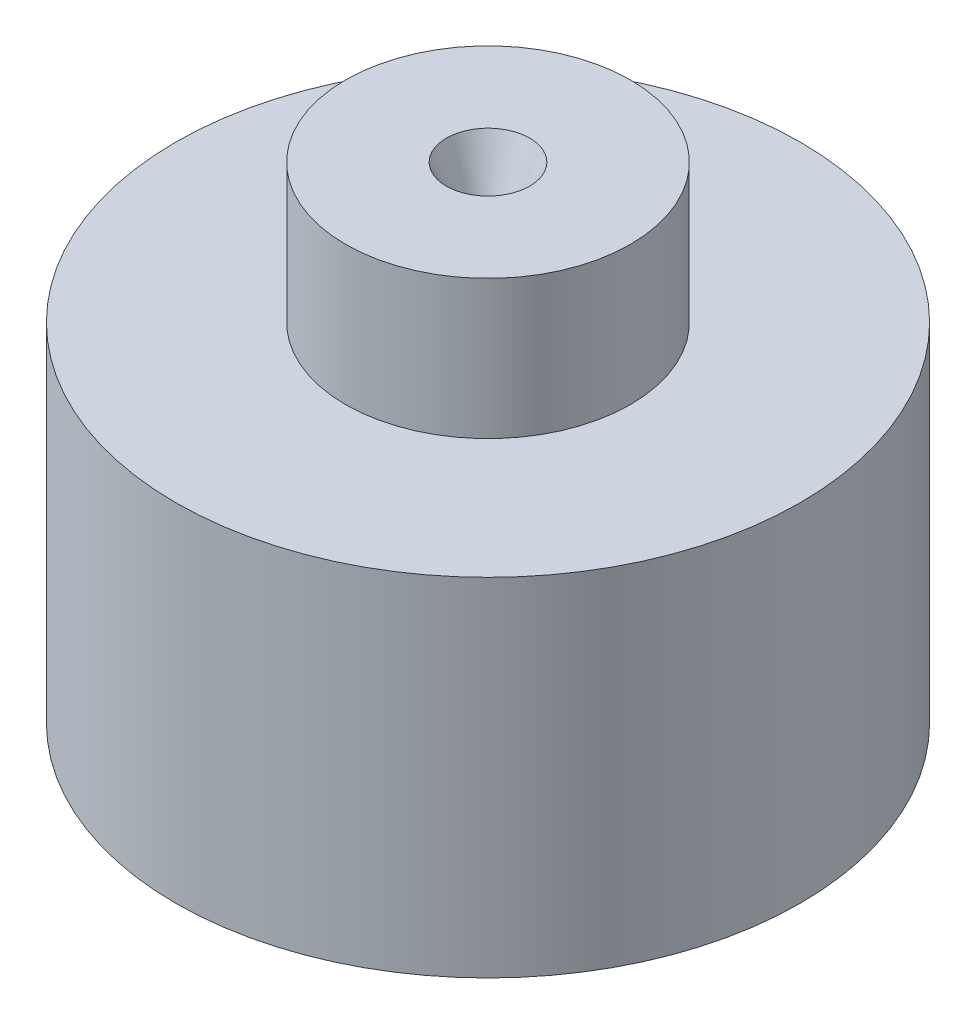
ISO-10303-21;
HEADER;
FILE_DESCRIPTION(('STEP AP214'),'2;1');
FILE_NAME('part.step','',(''),(''),'','','');
FILE_SCHEMA(('AUTOMOTIVE_DESIGN { 1 0 10303 214 1 1 1 1 }'));
ENDSEC;
DATA;
#1=APPLICATION_CONTEXT('core data for automotive mechanical design processes');
#2=APPLICATION_PROTOCOL_DEFINITION('international standard','automotive_design',2000,#1);
#3=PRODUCT_CONTEXT('',#1,'mechanical');
#4=PRODUCT('Part','Part','',(#3));
#5=PRODUCT_RELATED_PRODUCT_CATEGORY('part','',(#4));
#6=PRODUCT_DEFINITION_FORMATION('','',#4);
#7=PRODUCT_DEFINITION_CONTEXT('part definition',#1,'design');
#8=PRODUCT_DEFINITION('design','',#6,#7);
#9=PRODUCT_DEFINITION_SHAPE('','',#8);
#10=(LENGTH_UNIT() NAMED_UNIT(*) SI_UNIT(.MILLI.,.METRE.));
#11=(NAMED_UNIT(*) PLANE_ANGLE_UNIT() SI_UNIT($,.RADIAN.));
#12=(NAMED_UNIT(*) SI_UNIT($,.STERADIAN.) SOLID_ANGLE_UNIT());
#13=UNCERTAINTY_MEASURE_WITH_UNIT(LENGTH_MEASURE(1.E-05),#10,'distance_accuracy_value','');
#14=(GEOMETRIC_REPRESENTATION_CONTEXT(3) GLOBAL_UNCERTAINTY_ASSIGNED_CONTEXT((#13)) GLOBAL_UNIT_ASSIGNED_CONTEXT((#10,
#11,#12)) REPRESENTATION_CONTEXT('',''));
#15=CARTESIAN_POINT('',(0.,0.,0.));
#16=DIRECTION('',(0.,0.,1.));
#17=DIRECTION('',(1.,0.,0.));
#18=AXIS2_PLACEMENT_3D('',#15,#16,#17);
#19=CARTESIAN_POINT('',(0.,50.,0.));
#20=DIRECTION('',(0.,-1.,0.));
#21=DIRECTION('',(0.,0.,-1.));
#22=AXIS2_PLACEMENT_3D('',#19,#20,#21);
#23=CYLINDRICAL_SURFACE('',#22,45.);
#24=CARTESIAN_POINT('',(0.,50.,0.));
#25=DIRECTION('',(0.,1.,0.));
#26=DIRECTION('',(0.,0.,1.));
#27=AXIS2_PLACEMENT_3D('',#24,#25,#26);
#28=CIRCLE('',#27,45.);
#29=CARTESIAN_POINT('',(0.,50.,45.));
#30=VERTEX_POINT('',#29);
#31=EDGE_CURVE('E54',#30,#30,#28,.T.);
#32=ORIENTED_EDGE('',*,*,#31,.F.);
#33=EDGE_LOOP('',(#32));
#34=FACE_BOUND('',#33,.T.);
#35=CARTESIAN_POINT('',(0.,0.,0.));
#36=DIRECTION('',(0.,1.,0.));
#37=DIRECTION('',(0.,0.,1.));
#38=AXIS2_PLACEMENT_3D('',#35,#36,#37);
#39=CIRCLE('',#38,45.);
#40=CARTESIAN_POINT('',(0.,0.,45.));
#41=VERTEX_POINT('',#40);
#42=EDGE_CURVE('E60',#41,#41,#39,.T.);
#43=ORIENTED_EDGE('',*,*,#42,.T.);
#44=EDGE_LOOP('',(#43));
#45=FACE_BOUND('',#44,.T.);
#46=ADVANCED_FACE('F47',(#34,#45),#23,.T.);
#47=CARTESIAN_POINT('',(0.,50.,0.));
#48=DIRECTION('',(0.,1.,0.));
#49=DIRECTION('',(0.,0.,1.));
#50=AXIS2_PLACEMENT_3D('',#47,#48,#49);
#51=PLANE('',#50);
#52=CARTESIAN_POINT('',(0.,50.,0.));
#53=DIRECTION('',(0.,1.,0.));
#54=DIRECTION('',(0.,0.,1.));
#55=AXIS2_PLACEMENT_3D('',#52,#53,#54);
#56=CIRCLE('',#55,20.5229399547566);
#57=CARTESIAN_POINT('',(0.,50.,20.5229399547565));
#58=VERTEX_POINT('',#57);
#59=EDGE_CURVE('E10',#58,#58,#56,.T.);
#60=ORIENTED_EDGE('',*,*,#59,.F.);
#61=EDGE_LOOP('',(#60));
#62=FACE_BOUND('',#61,.T.);
#63=ORIENTED_EDGE('',*,*,#31,.T.);
#64=EDGE_LOOP('',(#63));
#65=FACE_BOUND('',#64,.T.);
#66=ADVANCED_FACE('F119',(#62,#65),#51,.T.);
#67=CARTESIAN_POINT('',(0.,0.,0.));
#68=DIRECTION('',(0.,1.,0.));
#69=DIRECTION('',(0.,0.,1.));
#70=AXIS2_PLACEMENT_3D('',#67,#68,#69);
#71=PLANE('',#70);
#72=CARTESIAN_POINT('',(0.,0.,0.));
#73=DIRECTION('',(0.,1.,0.));
#74=DIRECTION('',(0.,0.,1.));
#75=AXIS2_PLACEMENT_3D('',#72,#73,#74);
#76=CIRCLE('',#75,40.);
#77=CARTESIAN_POINT('',(0.,0.,40.));
#78=VERTEX_POINT('',#77);
#79=EDGE_CURVE('E67',#78,#78,#76,.T.);
#80=ORIENTED_EDGE('',*,*,#79,.T.);
#81=EDGE_LOOP('',(#80));
#82=FACE_BOUND('',#81,.T.);
#83=ORIENTED_EDGE('',*,*,#42,.F.);
#84=EDGE_LOOP('',(#83));
#85=FACE_BOUND('',#84,.T.);
#86=ADVANCED_FACE('F123',(#82,#85),#71,.F.);
#87=CARTESIAN_POINT('',(0.,50.,0.));
#88=DIRECTION('',(0.,1.,0.));
#89=DIRECTION('',(0.,0.,1.));
#90=AXIS2_PLACEMENT_3D('',#87,#88,#89);
#91=CYLINDRICAL_SURFACE('',#90,40.);
#92=ORIENTED_EDGE('',*,*,#79,.F.);
#93=EDGE_LOOP('',(#92));
#94=FACE_BOUND('',#93,.T.);
#95=CARTESIAN_POINT('',(0.,9.99999999999988,0.));
#96=DIRECTION('',(0.,1.,0.));
#97=DIRECTION('',(0.,0.,1.));
#98=AXIS2_PLACEMENT_3D('',#95,#96,#97);
#99=CIRCLE('',#98,40.);
#100=CARTESIAN_POINT('',(0.,9.99999999999989,40.));
#101=VERTEX_POINT('',#100);
#102=EDGE_CURVE('E72',#101,#101,#99,.T.);
#103=ORIENTED_EDGE('',*,*,#102,.T.);
#104=EDGE_LOOP('',(#103));
#105=FACE_BOUND('',#104,.T.);
#106=ADVANCED_FACE('F130',(#94,#105),#91,.F.);
#107=CARTESIAN_POINT('',(0.,9.99999999999989,40.));
#108=DIRECTION('',(0.,1.,0.));
#109=DIRECTION('',(0.,0.,1.));
#110=AXIS2_PLACEMENT_3D('',#107,#108,#109);
#111=PLANE('',#110);
#112=ORIENTED_EDGE('',*,*,#102,.F.);
#113=EDGE_LOOP('',(#112));
#114=FACE_BOUND('',#113,.T.);
#115=CARTESIAN_POINT('',(0.,9.99999999999988,0.));
#116=DIRECTION('',(0.,1.,0.));
#117=DIRECTION('',(0.,0.,1.));
#118=AXIS2_PLACEMENT_3D('',#115,#116,#117);
#119=CIRCLE('',#118,37.);
#120=CARTESIAN_POINT('',(0.,9.9999999999999,37.));
#121=VERTEX_POINT('',#120);
#122=EDGE_CURVE('E76',#121,#121,#119,.T.);
#123=ORIENTED_EDGE('',*,*,#122,.T.);
#124=EDGE_LOOP('',(#123));
#125=FACE_BOUND('',#124,.T.);
#126=ADVANCED_FACE('F134',(#114,#125),#111,.F.);
#127=CARTESIAN_POINT('',(0.,41.,0.));
#128=DIRECTION('',(0.,-1.,0.));
#129=DIRECTION('',(0.,0.,-1.));
#130=AXIS2_PLACEMENT_3D('',#127,#128,#129);
#131=CONICAL_SURFACE('',#130,6.00000000000001,0.785398163397446);
#132=ORIENTED_EDGE('',*,*,#122,.F.);
#133=EDGE_LOOP('',(#132));
#134=FACE_BOUND('',#133,.T.);
#135=CARTESIAN_POINT('',(0.,41.,0.));
#136=DIRECTION('',(0.,1.,0.));
#137=DIRECTION('',(0.,0.,1.));
#138=AXIS2_PLACEMENT_3D('',#135,#136,#137);
#139=CIRCLE('',#138,6.00000000000001);
#140=CARTESIAN_POINT('',(0.,41.,6.));
#141=VERTEX_POINT('',#140);
#142=EDGE_CURVE('E80',#141,#141,#139,.T.);
#143=ORIENTED_EDGE('',*,*,#142,.T.);
#144=EDGE_LOOP('',(#143));
#145=FACE_BOUND('',#144,.T.);
#146=ADVANCED_FACE('F140',(#134,#145),#131,.F.);
#147=CARTESIAN_POINT('',(0.,50.,0.));
#148=DIRECTION('',(0.,1.,0.));
#149=DIRECTION('',(0.,0.,1.));
#150=AXIS2_PLACEMENT_3D('',#147,#148,#149);
#151=CYLINDRICAL_SURFACE('',#150,6.00000000000001);
#152=ORIENTED_EDGE('',*,*,#142,.F.);
#153=EDGE_LOOP('',(#152));
#154=FACE_BOUND('',#153,.T.);
#155=CARTESIAN_POINT('',(0.,50.,0.));
#156=DIRECTION('',(0.,1.,0.));
#157=DIRECTION('',(0.,0.,1.));
#158=AXIS2_PLACEMENT_3D('',#155,#156,#157);
#159=CIRCLE('',#158,6.00000000000001);
#160=CARTESIAN_POINT('',(0.,50.,6.));
#161=VERTEX_POINT('',#160);
#162=EDGE_CURVE('E100',#161,#161,#159,.T.);
#163=ORIENTED_EDGE('',*,*,#162,.T.);
#164=EDGE_LOOP('',(#163));
#165=FACE_BOUND('',#164,.T.);
#166=ADVANCED_FACE('F106',(#154,#165),#151,.F.);
#167=CARTESIAN_POINT('',(0.,70.,0.));
#168=DIRECTION('',(0.,1.,0.));
#169=DIRECTION('',(0.,0.,1.));
#170=AXIS2_PLACEMENT_3D('',#167,#168,#169);
#171=CYLINDRICAL_SURFACE('',#170,20.5229399547566);
#172=ORIENTED_EDGE('',*,*,#59,.T.);
#173=EDGE_LOOP('',(#172));
#174=FACE_BOUND('',#173,.T.);
#175=CARTESIAN_POINT('',(0.,70.,0.));
#176=DIRECTION('',(0.,1.,0.));
#177=DIRECTION('',(0.,0.,1.));
#178=AXIS2_PLACEMENT_3D('',#175,#176,#177);
#179=CIRCLE('',#178,20.5229399547565);
#180=CARTESIAN_POINT('',(0.,70.,20.5229399547565));
#181=VERTEX_POINT('',#180);
#182=EDGE_CURVE('E84',#181,#181,#179,.T.);
#183=ORIENTED_EDGE('',*,*,#182,.F.);
#184=EDGE_LOOP('',(#183));
#185=FACE_BOUND('',#184,.T.);
#186=ADVANCED_FACE('F147',(#174,#185),#171,.T.);
#187=CARTESIAN_POINT('',(0.,70.,20.5229399547565));
#188=DIRECTION('',(0.,1.,0.));
#189=DIRECTION('',(0.,0.,1.));
#190=AXIS2_PLACEMENT_3D('',#187,#188,#189);
#191=PLANE('',#190);
#192=ORIENTED_EDGE('',*,*,#182,.T.);
#193=EDGE_LOOP('',(#192));
#194=FACE_BOUND('',#193,.T.);
#195=CARTESIAN_POINT('',(0.,70.,0.));
#196=DIRECTION('',(0.,1.,0.));
#197=DIRECTION('',(0.,0.,1.));
#198=AXIS2_PLACEMENT_3D('',#195,#196,#197);
#199=CIRCLE('',#198,6.);
#200=CARTESIAN_POINT('',(0.,70.,6.));
#201=VERTEX_POINT('',#200);
#202=EDGE_CURVE('E88',#201,#201,#199,.T.);
#203=ORIENTED_EDGE('',*,*,#202,.F.);
#204=EDGE_LOOP('',(#203));
#205=FACE_BOUND('',#204,.T.);
#206=ADVANCED_FACE('F151',(#194,#205),#191,.T.);
#207=CARTESIAN_POINT('',(0.,61.,0.));
#208=DIRECTION('',(0.,1.,0.));
#209=DIRECTION('',(0.,0.,1.));
#210=AXIS2_PLACEMENT_3D('',#207,#208,#209);
#211=CONICAL_SURFACE('',#210,2.24986987724109,0.394803438950979);
#212=ORIENTED_EDGE('',*,*,#202,.T.);
#213=EDGE_LOOP('',(#212));
#214=FACE_BOUND('',#213,.T.);
#215=CARTESIAN_POINT('',(0.,61.,0.));
#216=DIRECTION('',(0.,1.,0.));
#217=DIRECTION('',(0.,0.,1.));
#218=AXIS2_PLACEMENT_3D('',#215,#216,#217);
#219=CIRCLE('',#218,2.24986987724109);
#220=CARTESIAN_POINT('',(0.,61.,2.24986987724108));
#221=VERTEX_POINT('',#220);
#222=EDGE_CURVE('E92',#221,#221,#219,.T.);
#223=ORIENTED_EDGE('',*,*,#222,.F.);
#224=EDGE_LOOP('',(#223));
#225=FACE_BOUND('',#224,.T.);
#226=ADVANCED_FACE('F115',(#214,#225),#211,.F.);
#227=CARTESIAN_POINT('',(0.,70.,0.));
#228=DIRECTION('',(0.,1.,0.));
#229=DIRECTION('',(0.,0.,1.));
#230=AXIS2_PLACEMENT_3D('',#227,#228,#229);
#231=CYLINDRICAL_SURFACE('',#230,2.24986987724109);
#232=ORIENTED_EDGE('',*,*,#222,.T.);
#233=EDGE_LOOP('',(#232));
#234=FACE_BOUND('',#233,.T.);
#235=CARTESIAN_POINT('',(0.,59.,0.));
#236=DIRECTION('',(0.,1.,0.));
#237=DIRECTION('',(0.,0.,1.));
#238=AXIS2_PLACEMENT_3D('',#235,#236,#237);
#239=CIRCLE('',#238,2.24986987724109);
#240=CARTESIAN_POINT('',(0.,59.,2.24986987724108));
#241=VERTEX_POINT('',#240);
#242=EDGE_CURVE('E96',#241,#241,#239,.T.);
#243=ORIENTED_EDGE('',*,*,#242,.F.);
#244=EDGE_LOOP('',(#243));
#245=FACE_BOUND('',#244,.T.);
#246=ADVANCED_FACE('F110',(#234,#245),#231,.F.);
#247=CARTESIAN_POINT('',(0.,50.,0.));
#248=DIRECTION('',(0.,-1.,0.));
#249=DIRECTION('',(0.,0.,-1.));
#250=AXIS2_PLACEMENT_3D('',#247,#248,#249);
#251=CONICAL_SURFACE('',#250,6.00000000000001,0.39480343895098);
#252=ORIENTED_EDGE('',*,*,#242,.T.);
#253=EDGE_LOOP('',(#252));
#254=FACE_BOUND('',#253,.T.);
#255=ORIENTED_EDGE('',*,*,#162,.F.);
#256=EDGE_LOOP('',(#255));
#257=FACE_BOUND('',#256,.T.);
#258=ADVANCED_FACE('F108',(#254,#257),#251,.F.);
#259=CLOSED_SHELL('',(#46,#66,#86,#106,#126,#146,#166,#186,#206,#226,#246,#258));
#260=MANIFOLD_SOLID_BREP('B2',#259);
#261=ADVANCED_BREP_SHAPE_REPRESENTATION('',(#18,#260),#14);
#262=SHAPE_DEFINITION_REPRESENTATION(#9,#261);
ENDSEC;
END-ISO-10303-21;
